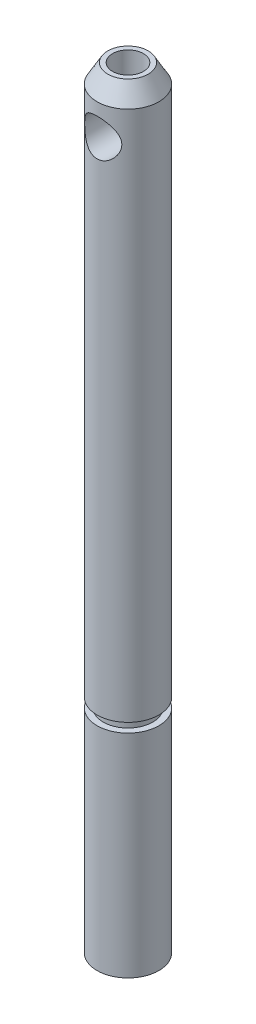
ISO-10303-21;
HEADER;
FILE_DESCRIPTION(('STEP AP214'),'2;1');
FILE_NAME('part.step','',(''),(''),'','','');
FILE_SCHEMA(('AUTOMOTIVE_DESIGN { 1 0 10303 214 1 1 1 1 }'));
ENDSEC;
DATA;
#1=APPLICATION_CONTEXT('core data for automotive mechanical design processes');
#2=APPLICATION_PROTOCOL_DEFINITION('international standard','automotive_design',2000,#1);
#3=PRODUCT_CONTEXT('',#1,'mechanical');
#4=PRODUCT('Part','Part','',(#3));
#5=PRODUCT_RELATED_PRODUCT_CATEGORY('part','',(#4));
#6=PRODUCT_DEFINITION_FORMATION('','',#4);
#7=PRODUCT_DEFINITION_CONTEXT('part definition',#1,'design');
#8=PRODUCT_DEFINITION('design','',#6,#7);
#9=PRODUCT_DEFINITION_SHAPE('','',#8);
#10=(LENGTH_UNIT() NAMED_UNIT(*) SI_UNIT(.MILLI.,.METRE.));
#11=(NAMED_UNIT(*) PLANE_ANGLE_UNIT() SI_UNIT($,.RADIAN.));
#12=(NAMED_UNIT(*) SI_UNIT($,.STERADIAN.) SOLID_ANGLE_UNIT());
#13=UNCERTAINTY_MEASURE_WITH_UNIT(LENGTH_MEASURE(1.E-05),#10,'distance_accuracy_value','');
#14=(GEOMETRIC_REPRESENTATION_CONTEXT(3) GLOBAL_UNCERTAINTY_ASSIGNED_CONTEXT((#13)) GLOBAL_UNIT_ASSIGNED_CONTEXT((#10,
#11,#12)) REPRESENTATION_CONTEXT('',''));
#15=CARTESIAN_POINT('',(0.,0.,0.));
#16=DIRECTION('',(0.,0.,1.));
#17=DIRECTION('',(1.,0.,0.));
#18=AXIS2_PLACEMENT_3D('',#15,#16,#17);
#19=CARTESIAN_POINT('',(0.,62.34264779,0.));
#20=DIRECTION('',(0.,-1.,0.));
#21=DIRECTION('',(0.,0.,-1.));
#22=AXIS2_PLACEMENT_3D('',#19,#20,#21);
#23=CYLINDRICAL_SURFACE('',#22,2.5);
#24=CARTESIAN_POINT('',(0.,17.9,0.));
#25=DIRECTION('',(0.,1.,0.));
#26=DIRECTION('',(0.,0.,1.));
#27=AXIS2_PLACEMENT_3D('',#24,#25,#26);
#28=CIRCLE('',#27,2.5);
#29=CARTESIAN_POINT('',(0.,17.9,2.5));
#30=VERTEX_POINT('',#29);
#31=EDGE_CURVE('E40',#30,#30,#28,.T.);
#32=ORIENTED_EDGE('',*,*,#31,.T.);
#33=EDGE_LOOP('',(#32));
#34=FACE_BOUND('',#33,.T.);
#35=CARTESIAN_POINT('',(-1.11022302462516E-13,59.84264779,-2.49999999999995));
#36=CARTESIAN_POINT('',(-0.0767298334621174,59.8426436989901,-2.4999962578972));
#37=CARTESIAN_POINT('',(-0.153582320644271,59.8367191190737,-2.49642904615007));
#38=CARTESIAN_POINT('',(-0.304975509530748,59.8133234704847,-2.48249903608569));
#39=CARTESIAN_POINT('',(-0.379510034596101,59.7958239281458,-2.47211948032716));
#40=CARTESIAN_POINT('',(-0.523751827790889,59.7502614288332,-2.44561558054483));
#41=CARTESIAN_POINT('',(-0.593481028226631,59.7222508318369,-2.42951973272941));
#42=CARTESIAN_POINT('',(-0.727030318214732,59.656787456859,-2.39295367626406));
#43=CARTESIAN_POINT('',(-0.790851869416452,59.6193370230312,-2.37248455380253));
#44=CARTESIAN_POINT('',(-0.916299278999388,59.5328729632914,-2.32705360719085));
#45=CARTESIAN_POINT('',(-0.977384020081503,59.4831940946486,-2.30186792195981));
#46=CARTESIAN_POINT('',(-1.09088270411895,59.3751805861718,-2.25030439279632));
#47=CARTESIAN_POINT('',(-1.1432853494811,59.3168348528127,-2.22392505153574));
#48=CARTESIAN_POINT('',(-1.24444996762973,59.1847242795032,-2.16911066995912));
#49=CARTESIAN_POINT('',(-1.29197766378817,59.1099460190188,-2.14082017703644));
#50=CARTESIAN_POINT('',(-1.37361437764906,58.9518012167569,-2.08938301412118));
#51=CARTESIAN_POINT('',(-1.40774517335162,58.8684488937524,-2.06622802273939));
#52=CARTESIAN_POINT('',(-1.45440601714227,58.7160513393467,-2.03354629660929));
#53=CARTESIAN_POINT('',(-1.47016197246839,58.6484117913897,-2.02207883137583));
#54=CARTESIAN_POINT('',(-1.49216172340484,58.5108440741697,-2.00590308295495));
#55=CARTESIAN_POINT('',(-1.49841734556833,58.4409188612455,-2.00118639643758));
#56=CARTESIAN_POINT('',(-1.50105508796006,58.3006362957827,-1.99920922463854));
#57=CARTESIAN_POINT('',(-1.49741783408428,58.2302783649068,-2.0019633701271));
#58=CARTESIAN_POINT('',(-1.4804606047884,58.0913690145724,-2.01453261443733));
#59=CARTESIAN_POINT('',(-1.46713334620107,58.0228189941526,-2.02435302432224));
#60=CARTESIAN_POINT('',(-1.43173921881794,57.8901175478719,-2.04953186944256));
#61=CARTESIAN_POINT('',(-1.40978748666095,57.8259207360755,-2.06481711652529));
#62=CARTESIAN_POINT('',(-1.35795061770849,57.7019527990718,-2.09927051350823));
#63=CARTESIAN_POINT('',(-1.32806257259713,57.6421833065761,-2.11844008623469));
#64=CARTESIAN_POINT('',(-1.2551798318459,57.5176636928772,-2.16255327268992));
#65=CARTESIAN_POINT('',(-1.21080724397733,57.4538696970451,-2.18792043372989));
#66=CARTESIAN_POINT('',(-1.11291092784015,57.333971306333,-2.23930599764373));
#67=CARTESIAN_POINT('',(-1.05937845100591,57.2778743560235,-2.26532500262146));
#68=CARTESIAN_POINT('',(-0.935811834383079,57.1670348081783,-2.31935504958316));
#69=CARTESIAN_POINT('',(-0.864517682705066,57.113570483984,-2.34713836268528));
#70=CARTESIAN_POINT('',(-0.712276050459084,57.0195257428021,-2.39772428433978));
#71=CARTESIAN_POINT('',(-0.631333763943626,56.9789384362101,-2.42052955425519));
#72=CARTESIAN_POINT('',(-0.467197585268263,56.9147156072041,-2.45730392066156));
#73=CARTESIAN_POINT('',(-0.384467624173656,56.8901724342841,-2.47173957439704));
#74=CARTESIAN_POINT('',(-0.215047895144745,56.8556365925946,-2.49218842813548));
#75=CARTESIAN_POINT('',(-0.128363005661436,56.8456264722464,-2.49821172952736));
#76=CARTESIAN_POINT('',(0.0337146143772834,56.8411399423217,-2.5009057037461));
#77=CARTESIAN_POINT('',(0.109042473418621,56.8447389349148,-2.49873521714286));
#78=CARTESIAN_POINT('',(0.257829401985992,56.8630736430719,-2.48778712087049));
#79=CARTESIAN_POINT('',(0.33128850937605,56.8778091328058,-2.47900964518037));
#80=CARTESIAN_POINT('',(0.472574932157574,56.9171912228125,-2.4559479244219));
#81=CARTESIAN_POINT('',(0.540495750928449,56.9415881390735,-2.44180275662557));
#82=CARTESIAN_POINT('',(0.671265749087234,56.9993251663653,-2.40913880862845));
#83=CARTESIAN_POINT('',(0.734113924963882,57.0326670413467,-2.39061916586509));
#84=CARTESIAN_POINT('',(0.860006262823819,57.1112047692087,-2.34845496237357));
#85=CARTESIAN_POINT('',(0.922394150456773,57.1572716190784,-2.3244780273988));
#86=CARTESIAN_POINT('',(1.03902603131008,57.2580391834886,-2.27474265574737));
#87=CARTESIAN_POINT('',(1.09326040273734,57.3127499448525,-2.24898216586368));
#88=CARTESIAN_POINT('',(1.19931996735574,57.4375581800371,-2.19445423909899));
#89=CARTESIAN_POINT('',(1.24991019630905,57.5087316754655,-2.16573241746296));
#90=CARTESIAN_POINT('',(1.33845238915658,57.6598638145682,-2.11216182066716));
#91=CARTESIAN_POINT('',(1.37641766769777,57.7398130838928,-2.08730897997701));
#92=CARTESIAN_POINT('',(1.43142578795771,57.8888908123067,-2.0498490924053));
#93=CARTESIAN_POINT('',(1.45121625336179,57.9566281023586,-2.03575659328737));
#94=CARTESIAN_POINT('',(1.48113663905961,58.0951798680801,-2.01409605743551));
#95=CARTESIAN_POINT('',(1.49127995297625,58.1659899343278,-2.00651897642729));
#96=CARTESIAN_POINT('',(1.50134130416625,58.309024737597,-1.99900446616276));
#97=CARTESIAN_POINT('',(1.50122089107857,58.381253780687,-1.99909576445944));
#98=CARTESIAN_POINT('',(1.49066472959318,58.5245422256094,-2.0069771789286));
#99=CARTESIAN_POINT('',(1.48022337215755,58.5956009700806,-2.01477148138835));
#100=CARTESIAN_POINT('',(1.45040174148908,58.7311362075722,-2.03633185242994));
#101=CARTESIAN_POINT('',(1.43147636845339,58.7957648843068,-2.04979211805588));
#102=CARTESIAN_POINT('',(1.38563242076985,58.9209850444742,-2.08105501960158));
#103=CARTESIAN_POINT('',(1.35871083588482,58.9815749969605,-2.09885929040494));
#104=CARTESIAN_POINT('',(1.29289245555737,59.1069676472208,-2.14012990550929));
#105=CARTESIAN_POINT('',(1.25279167675747,59.1709888938543,-2.16404587582644));
#106=CARTESIAN_POINT('',(1.16375698389073,59.2920278626172,-2.21320127030773));
#107=CARTESIAN_POINT('',(1.11481579607792,59.3490397521525,-2.23844177205034));
#108=CARTESIAN_POINT('',(1.0000977742573,59.4639987391317,-2.29225690291491));
#109=CARTESIAN_POINT('',(0.932876819313819,59.5205788648962,-2.32070308663664));
#110=CARTESIAN_POINT('',(0.788462434445498,59.6217456458633,-2.37365428872368));
#111=CARTESIAN_POINT('',(0.71126544450149,59.6663280019848,-2.3981578931094));
#112=CARTESIAN_POINT('',(0.551125230801416,59.7404335975737,-2.439855786544));
#113=CARTESIAN_POINT('',(0.468430086957148,59.7703758549268,-2.4572507747979));
#114=CARTESIAN_POINT('',(0.297973306118717,59.815372485211,-2.48366273001245));
#115=CARTESIAN_POINT('',(0.210232099648526,59.8304829578571,-2.49271125871481));
#116=CARTESIAN_POINT('',(0.101558096917439,59.8393452447087,-2.49802001168187));
#117=CARTESIAN_POINT('',(0.0812762590281778,59.8405822073061,-2.49876114656363));
#118=CARTESIAN_POINT('',(0.0406658206870069,59.8422340363708,-2.49975164517366));
#119=CARTESIAN_POINT('',(0.0203372186374612,59.8426488743209,-2.50000099184312));
#120=CARTESIAN_POINT('',(-1.11022302462516E-13,59.84264779,-2.49999999999995));
#121=B_SPLINE_CURVE_WITH_KNOTS('',3,(#35,#36,#37,#38,#39,#40,#41,#42,#43,#44,#45,#46,#47,#48,
#49,#50,#51,#52,#53,#54,#55,#56,#57,#58,#59,#60,#61,#62,#63,#64,#65,#66,#67,#68,#69,#70,#71,#72,
#73,#74,#75,#76,#77,#78,#79,#80,#81,#82,#83,#84,#85,#86,#87,#88,#89,#90,#91,#92,#93,#94,#95,#96,
#97,#98,#99,#100,#101,#102,#103,#104,#105,#106,#107,#108,#109,#110,#111,#112,#113,#114,#115,
#116,#117,#118,#119,#120),.UNSPECIFIED.,.T.,.F.,(4,2,2,2,2,2,2,2,2,2,2,2,2,2,2,2,2,2,2,2,2,2,2,
2,2,2,2,2,2,2,2,2,2,2,2,2,2,2,2,2,2,2,4),(0.,0.230102237548619,0.460772627519939,
0.690308884599963,0.919788197992259,1.16681590732466,1.41416257934789,1.69183813189801,
1.96906040692088,2.17933829855627,2.3893542091657,2.59978170870722,2.8103675327387,
3.01823267593203,3.22617409809863,3.47046995225156,3.71500044803666,3.99360957884687,
4.27206939275325,4.53296790696556,4.79355286918228,5.01875602722423,5.24395461863456,
5.46367785689774,5.68344445659029,5.92601365818361,6.16886690081831,6.44336762428004,
6.71757792616452,6.93257787314688,7.14727888733312,7.36278425777426,7.57840681155719,
7.78364098331133,7.98895251523023,8.22578610052278,8.46281544370203,8.73854311775512,
9.01436946031975,9.2817565446267,9.54812832184443,9.60911473335172,9.67010326027637),.UNSPECIFIED.);
#122=CARTESIAN_POINT('',(-1.11022302462516E-13,59.84264779,-2.49999999999995));
#123=VERTEX_POINT('',#122);
#124=EDGE_CURVE('E87',#123,#123,#121,.T.);
#125=ORIENTED_EDGE('',*,*,#124,.T.);
#126=EDGE_LOOP('',(#125));
#127=FACE_BOUND('',#126,.T.);
#128=CARTESIAN_POINT('',(1.50000000000006,58.34264779,1.99999999999989));
#129=CARTESIAN_POINT('',(1.50000404108597,58.2671688147104,1.99999416642502));
#130=CARTESIAN_POINT('',(1.49426852824004,58.1917093559202,2.00433633903488));
#131=CARTESIAN_POINT('',(1.47174965152777,58.0433238860378,2.02092590613891));
#132=CARTESIAN_POINT('',(1.45495475788939,57.9704006026149,2.03318155043089));
#133=CARTESIAN_POINT('',(1.41143486335801,57.8295641483227,2.0636233903472));
#134=CARTESIAN_POINT('',(1.38478154503145,57.7616189519648,2.08176666183123));
#135=CARTESIAN_POINT('',(1.32252909283014,57.6312103366322,2.12185904995839));
#136=CARTESIAN_POINT('',(1.28692729054697,57.5687485603049,2.14380930122404));
#137=CARTESIAN_POINT('',(1.20271292747652,57.4426987733359,2.19228594587526));
#138=CARTESIAN_POINT('',(1.15304179435289,57.3799068328761,2.21904371037659));
#139=CARTESIAN_POINT('',(1.04426801309981,57.2628830272583,2.27226229431066));
#140=CARTESIAN_POINT('',(0.985158296729598,57.2086576383292,2.29872287517103));
#141=CARTESIAN_POINT('',(0.851442367411699,57.1045139802903,2.35175567858731));
#142=CARTESIAN_POINT('',(0.775851995162529,57.0556933263303,2.37803133577816));
#143=CARTESIAN_POINT('',(0.615654228271661,56.9718380675556,2.42443786983181));
#144=CARTESIAN_POINT('',(0.531055196626372,56.9367908158773,2.4445743798874));
#145=CARTESIAN_POINT('',(0.363771406742733,56.8850518671873,2.47470987800445));
#146=CARTESIAN_POINT('',(0.281674698130973,56.8669274290327,2.48549303939172));
#147=CARTESIAN_POINT('',(0.114970509382765,56.8447049871369,2.49874939277542));
#148=CARTESIAN_POINT('',(0.0303654624002182,56.8405938119999,2.50123038813301));
#149=CARTESIAN_POINT('',(-0.127637283737264,56.8462615373424,2.49783372711535));
#150=CARTESIAN_POINT('',(-0.201123832865614,56.8543813161693,2.49295437513726));
#151=CARTESIAN_POINT('',(-0.345464269151774,56.8811275856481,2.47707997553857));
#152=CARTESIAN_POINT('',(-0.41631796105121,56.8997548539071,2.46608447529306));
#153=CARTESIAN_POINT('',(-0.554056780469106,56.9468133527038,2.43884907201714));
#154=CARTESIAN_POINT('',(-0.620916491037661,56.9753008511389,2.42257910450821));
#155=CARTESIAN_POINT('',(-0.74898866011564,57.0410324062255,2.38609637638749));
#156=CARTESIAN_POINT('',(-0.81019964620801,57.078278737059,2.36588259201815));
#157=CARTESIAN_POINT('',(-0.933074267143204,57.1654868828044,2.32037925976365));
#158=CARTESIAN_POINT('',(-0.993918663198241,57.2164361017356,2.29477182952148));
#159=CARTESIAN_POINT('',(-1.10671465909276,57.3270519078601,2.242555542456));
#160=CARTESIAN_POINT('',(-1.15865401308333,57.3867302934745,2.2159453670338));
#161=CARTESIAN_POINT('',(-1.25824837767412,57.5213011961636,2.1611107512395));
#162=CARTESIAN_POINT('',(-1.30470933188639,57.5971553665394,2.13305661385121));
#163=CARTESIAN_POINT('',(-1.38397217194241,57.7573540216365,2.0825087955726));
#164=CARTESIAN_POINT('',(-1.41679921962188,57.8416825061256,2.06000490298818));
#165=CARTESIAN_POINT('',(-1.46077497064846,57.9950414218953,2.02895865196727));
#166=CARTESIAN_POINT('',(-1.47527903312676,58.0626884222966,2.01833888618307));
#167=CARTESIAN_POINT('',(-1.49480872755294,58.2000214002994,2.0039215077755));
#168=CARTESIAN_POINT('',(-1.49984538302908,58.2697049104845,2.00011596115112));
#169=CARTESIAN_POINT('',(-1.50014781114185,58.4091994724357,1.99988914321318));
#170=CARTESIAN_POINT('',(-1.49540004697672,58.4790105672152,2.00347810223975));
#171=CARTESIAN_POINT('',(-1.47640290574949,58.6166351337486,2.01751520788646));
#172=CARTESIAN_POINT('',(-1.46214601830133,58.6844469822403,2.02796877613213));
#173=CARTESIAN_POINT('',(-1.42488312618649,58.8163623694798,2.05431768333102));
#174=CARTESIAN_POINT('',(-1.40188805257368,58.8804704265323,2.07020622092808));
#175=CARTESIAN_POINT('',(-1.34796261057081,59.0041255057302,2.10571539417582));
#176=CARTESIAN_POINT('',(-1.31702924888211,59.063670796366,2.12533743689998));
#177=CARTESIAN_POINT('',(-1.24167439558507,59.1878878725122,2.17036819177738));
#178=CARTESIAN_POINT('',(-1.19582663060306,59.2515486250966,2.19618239397367));
#179=CARTESIAN_POINT('',(-1.09487395518707,59.3709332748495,2.24821754803618));
#180=CARTESIAN_POINT('',(-1.03976018672402,59.4266494821691,2.27443886711456));
#181=CARTESIAN_POINT('',(-0.913274837212728,59.5358717973504,2.32835625910917));
#182=CARTESIAN_POINT('',(-0.840721108780187,59.5881485166059,2.35580075875872));
#183=CARTESIAN_POINT('',(-0.686103100868014,59.6795505668367,2.40537639133457));
#184=CARTESIAN_POINT('',(-0.604045176134661,59.7186846178409,2.42751104449406));
#185=CARTESIAN_POINT('',(-0.438840232972077,59.7795159934314,2.46252280092772));
#186=CARTESIAN_POINT('',(-0.35620596365121,59.8022740177911,2.47595588067328));
#187=CARTESIAN_POINT('',(-0.187383063890822,59.8333623928463,2.49440738906101));
#188=CARTESIAN_POINT('',(-0.101198571781933,59.8417090807176,2.49943534582738));
#189=CARTESIAN_POINT('',(0.0598120232010074,59.8433223985859,2.50040600461976));
#190=CARTESIAN_POINT('',(0.134620583589719,59.838451124563,2.49747057186327));
#191=CARTESIAN_POINT('',(0.282148755978779,59.8177539656184,2.48512948412096));
#192=CARTESIAN_POINT('',(0.354868344701922,59.8019279586784,2.4757237570664));
#193=CARTESIAN_POINT('',(0.495145481978799,59.7604282184162,2.45149427526962));
#194=CARTESIAN_POINT('',(0.562767032608823,59.7349161938707,2.43675966858905));
#195=CARTESIAN_POINT('',(0.69278197200002,59.6750071954452,2.40303337447155));
#196=CARTESIAN_POINT('',(0.75517418419992,59.6406082291404,2.38404073252271));
#197=CARTESIAN_POINT('',(0.880263645296024,59.5597225934312,2.34093432659385));
#198=CARTESIAN_POINT('',(0.942258690439942,59.512329080983,2.31648844639152));
#199=CARTESIAN_POINT('',(1.05789751536307,59.4088947562822,2.26601907350658));
#200=CARTESIAN_POINT('',(1.11153190956925,59.3528443643921,2.23999385274502));
#201=CARTESIAN_POINT('',(1.21590975350577,59.2253622278223,2.185281656662));
#202=CARTESIAN_POINT('',(1.26542406663362,59.1528813038344,2.15667566270905));
#203=CARTESIAN_POINT('',(1.35156817210321,58.9991629372333,2.10376464485147));
#204=CARTESIAN_POINT('',(1.38820466322671,58.9179300760185,2.07945738811042));
#205=CARTESIAN_POINT('',(1.44437116535138,58.7555835048628,2.04080003047955));
#206=CARTESIAN_POINT('',(1.46509526060177,58.6750525540387,2.02577665830147));
#207=CARTESIAN_POINT('',(1.49289268240416,58.5105503952962,2.00539032320042));
#208=CARTESIAN_POINT('',(1.49999550595843,58.4265870242412,2.00000648744631));
#209=CARTESIAN_POINT('',(1.50000000000006,58.34264779,1.99999999999989));
#210=B_SPLINE_CURVE_WITH_KNOTS('',3,(#128,#129,#130,#131,#132,#133,#134,#135,#136,#137,#138,
#139,#140,#141,#142,#143,#144,#145,#146,#147,#148,#149,#150,#151,#152,#153,#154,#155,#156,#157,
#158,#159,#160,#161,#162,#163,#164,#165,#166,#167,#168,#169,#170,#171,#172,#173,#174,#175,#176,
#177,#178,#179,#180,#181,#182,#183,#184,#185,#186,#187,#188,#189,#190,#191,#192,#193,#194,#195,
#196,#197,#198,#199,#200,#201,#202,#203,#204,#205,#206,#207,#208,#209),.UNSPECIFIED.,.T.,.F.,(4,
2,2,2,2,2,2,2,2,2,2,2,2,2,2,2,2,2,2,2,2,2,2,2,2,2,2,2,2,2,2,2,2,2,2,2,2,2,2,2,4),(0.,
0.226085249493357,0.452406574330706,0.677113624991797,0.901887762215826,1.15414462389994,
1.40659128601841,1.68630157736218,1.96575443271212,2.21853330858488,2.47107452602757,
2.69230130543177,2.91354445887945,3.13607155036375,3.35865648368874,3.60782810055843,
3.85733966656903,4.13576671140274,4.41367760154768,4.62276298054685,4.83160475643979,
5.04073566011189,5.25003193304139,5.45906724365505,5.66818149154669,5.91499438482012,
6.16204457978465,6.441218280116,6.72020638384861,6.97891479383351,7.23732973022738,
7.46129321849409,7.68525920139656,7.90563970188768,8.126069653946,8.37042963549502,
8.6150619874197,8.89071695766618,9.16622832484817,9.41820120134364,9.66962780912285),.UNSPECIFIED.);
#211=CARTESIAN_POINT('',(1.50000000000006,58.34264779,1.99999999999989));
#212=VERTEX_POINT('',#211);
#213=EDGE_CURVE('E80',#212,#212,#210,.T.);
#214=ORIENTED_EDGE('',*,*,#213,.T.);
#215=EDGE_LOOP('',(#214));
#216=FACE_BOUND('',#215,.T.);
#217=CARTESIAN_POINT('',(0.,60.84264779,0.));
#218=DIRECTION('',(0.,1.,0.));
#219=DIRECTION('',(0.,0.,1.));
#220=AXIS2_PLACEMENT_3D('',#217,#218,#219);
#221=CIRCLE('',#220,2.5);
#222=CARTESIAN_POINT('',(0.,60.84264779,2.5));
#223=VERTEX_POINT('',#222);
#224=EDGE_CURVE('E114',#223,#223,#221,.F.);
#225=ORIENTED_EDGE('',*,*,#224,.T.);
#226=EDGE_LOOP('',(#225));
#227=FACE_BOUND('',#226,.T.);
#228=ADVANCED_FACE('F36',(#34,#127,#216,#227),#23,.T.);
#229=CARTESIAN_POINT('',(0.,62.34264779,0.));
#230=DIRECTION('',(0.,1.,0.));
#231=DIRECTION('',(0.,0.,1.));
#232=AXIS2_PLACEMENT_3D('',#229,#230,#231);
#233=PLANE('',#232);
#234=CARTESIAN_POINT('',(0.,62.34264779,0.));
#235=DIRECTION('',(0.,1.,0.));
#236=DIRECTION('',(0.,0.,1.));
#237=AXIS2_PLACEMENT_3D('',#234,#235,#236);
#238=CIRCLE('',#237,1.24999999999999);
#239=CARTESIAN_POINT('',(0.,62.34264779,1.24999999999999));
#240=VERTEX_POINT('',#239);
#241=EDGE_CURVE('E165',#240,#240,#238,.T.);
#242=ORIENTED_EDGE('',*,*,#241,.F.);
#243=EDGE_LOOP('',(#242));
#244=FACE_BOUND('',#243,.T.);
#245=CARTESIAN_POINT('',(0.,62.34264779,0.));
#246=DIRECTION('',(0.,1.,0.));
#247=DIRECTION('',(0.,0.,1.));
#248=AXIS2_PLACEMENT_3D('',#245,#246,#247);
#249=CIRCLE('',#248,1.63397459621555);
#250=CARTESIAN_POINT('',(0.,62.34264779,1.63397459621555));
#251=VERTEX_POINT('',#250);
#252=EDGE_CURVE('E164',#251,#251,#249,.T.);
#253=ORIENTED_EDGE('',*,*,#252,.T.);
#254=EDGE_LOOP('',(#253));
#255=FACE_BOUND('',#254,.T.);
#256=ADVANCED_FACE('F144',(#244,#255),#233,.T.);
#257=CARTESIAN_POINT('',(0.,62.34264779,0.));
#258=DIRECTION('',(0.,-1.,0.));
#259=DIRECTION('',(0.,0.,-1.));
#260=AXIS2_PLACEMENT_3D('',#257,#258,#259);
#261=CONICAL_SURFACE('',#260,1.63397459621555,0.523598775598299);
#262=ORIENTED_EDGE('',*,*,#224,.F.);
#263=EDGE_LOOP('',(#262));
#264=FACE_BOUND('',#263,.T.);
#265=ORIENTED_EDGE('',*,*,#252,.F.);
#266=EDGE_LOOP('',(#265));
#267=FACE_BOUND('',#266,.T.);
#268=ADVANCED_FACE('F38',(#264,#267),#261,.T.);
#269=CARTESIAN_POINT('',(0.,62.34264779,0.));
#270=DIRECTION('',(0.,1.,0.));
#271=DIRECTION('',(0.,0.,1.));
#272=AXIS2_PLACEMENT_3D('',#269,#270,#271);
#273=CYLINDRICAL_SURFACE('',#272,1.24999999999999);
#274=CARTESIAN_POINT('',(0.,59.84264779,1.24999999999997));
#275=CARTESIAN_POINT('',(-0.0593787688504902,59.8426453960051,1.24999755162012));
#276=CARTESIAN_POINT('',(-0.118775657075955,59.8390911230602,1.24573873608633));
#277=CARTESIAN_POINT('',(-0.235591229710231,59.8252016242696,1.22901865029432));
#278=CARTESIAN_POINT('',(-0.29300841589432,59.8148613764697,1.21655130529971));
#279=CARTESIAN_POINT('',(-0.403915034737275,59.7883611698592,1.18434389929647));
#280=CARTESIAN_POINT('',(-0.457425697494237,59.7722360079471,1.16464730700097));
#281=CARTESIAN_POINT('',(-0.559920458095034,59.7352939358074,1.1189916319036));
#282=CARTESIAN_POINT('',(-0.60890301880444,59.7144754405418,1.09303043320275));
#283=CARTESIAN_POINT('',(-0.718951202770143,59.6610173962405,1.02527232994856));
#284=CARTESIAN_POINT('',(-0.777846384687494,59.6268446330919,0.981161424597099));
#285=CARTESIAN_POINT('',(-0.88600669034169,59.5547668337134,0.884741320224268));
#286=CARTESIAN_POINT('',(-0.935244207719127,59.5168515508956,0.832409367774614));
#287=CARTESIAN_POINT('',(-1.02476981505217,59.4396432682186,0.719475666551739));
#288=CARTESIAN_POINT('',(-1.06487540714465,59.4003377572932,0.65873878899535));
#289=CARTESIAN_POINT('',(-1.13460946975338,59.3251211682379,0.529649327753183));
#290=CARTESIAN_POINT('',(-1.16426870455498,59.2892003550434,0.461319899248879));
#291=CARTESIAN_POINT('',(-1.2009680938634,59.2416144929299,0.349152321823399));
#292=CARTESIAN_POINT('',(-1.21216917699589,59.2263312437798,0.308234151359252));
#293=CARTESIAN_POINT('',(-1.23050643018313,59.2006117998924,0.224058908581022));
#294=CARTESIAN_POINT('',(-1.23765246650147,59.1901638520024,0.180807796016875));
#295=CARTESIAN_POINT('',(-1.24740539483337,59.1757529297614,0.0921161932337585));
#296=CARTESIAN_POINT('',(-1.24995600781895,59.1718703953019,0.0466554691685001));
#297=CARTESIAN_POINT('',(-1.25004286433055,59.1717392801723,-0.0442807551980311));
#298=CARTESIAN_POINT('',(-1.24757904212986,59.1754907995654,-0.0897562556851739));
#299=CARTESIAN_POINT('',(-1.23752620102334,59.1903556786056,-0.182763549838961));
#300=CARTESIAN_POINT('',(-1.22952745139611,59.2020561024571,-0.230151202597545));
#301=CARTESIAN_POINT('',(-1.20871318849993,59.231090323166,-0.322101145839428));
#302=CARTESIAN_POINT('',(-1.19588169148347,59.248442787456,-0.366653480876624));
#303=CARTESIAN_POINT('',(-1.15722563130137,59.2977869247082,-0.478104397695259));
#304=CARTESIAN_POINT('',(-1.12819923859676,59.3323823317423,-0.542714880205897));
#305=CARTESIAN_POINT('',(-1.0607172410451,59.4044114169617,-0.66502873901156));
#306=CARTESIAN_POINT('',(-1.02224478491081,59.4418500840155,-0.722719494040659));
#307=CARTESIAN_POINT('',(-0.933838554257848,59.5180327498887,-0.834120412783252));
#308=CARTESIAN_POINT('',(-0.883411408236051,59.556742899928,-0.887465696388253));
#309=CARTESIAN_POINT('',(-0.772419565040695,59.6301969049584,-0.985559630438903));
#310=CARTESIAN_POINT('',(-0.711877274428563,59.6649492470877,-1.03032682216843));
#311=CARTESIAN_POINT('',(-0.59705631416896,59.7197916838296,-1.09970681083113));
#312=CARTESIAN_POINT('',(-0.544863772530677,59.7413893589319,-1.12657128594302));
#313=CARTESIAN_POINT('',(-0.435535617240919,59.7791869914236,-1.1731715356764));
#314=CARTESIAN_POINT('',(-0.378403116632057,59.7953903174189,-1.19291175982449));
#315=CARTESIAN_POINT('',(-0.259977180591779,59.8211969118404,-1.22420858059791));
#316=CARTESIAN_POINT('',(-0.198655468325038,59.8307491801647,-1.23570196071463));
#317=CARTESIAN_POINT('',(-0.0742799817039903,59.8421049772496,-1.24935462856928));
#318=CARTESIAN_POINT('',(-0.0112273946835203,59.8439136904991,-1.25152016152218));
#319=CARTESIAN_POINT('',(0.106655102299903,59.839872777293,-1.2466687749113));
#320=CARTESIAN_POINT('',(0.161565285324155,59.8349145251792,-1.24072067022759));
#321=CARTESIAN_POINT('',(0.269322467292328,59.8192757557052,-1.22186653531031));
#322=CARTESIAN_POINT('',(0.322169217931461,59.808594551932,-1.20895967043917));
#323=CARTESIAN_POINT('',(0.425282807428064,59.7820953311318,-1.17668826548714));
#324=CARTESIAN_POINT('',(0.475505558665462,59.7662103651791,-1.15723946784767));
#325=CARTESIAN_POINT('',(0.571829286856163,59.7303286630424,-1.11280232131271));
#326=CARTESIAN_POINT('',(0.617928731328829,59.7103304071373,-1.08781192471693));
#327=CARTESIAN_POINT('',(0.725338376691851,59.6575222014701,-1.02078335853516));
#328=CARTESIAN_POINT('',(0.784177111169704,59.6229929252154,-0.976130353623708));
#329=CARTESIAN_POINT('',(0.892139643516418,59.5502661221268,-0.878583173972398));
#330=CARTESIAN_POINT('',(0.941232285418773,59.5120573931547,-0.825663506224549));
#331=CARTESIAN_POINT('',(1.03033901299864,59.434412103151,-0.711512047530491));
#332=CARTESIAN_POINT('',(1.07017375330089,59.3949658211159,-0.650147769366086));
#333=CARTESIAN_POINT('',(1.13922410535005,59.3197536503251,-0.519707419852047));
#334=CARTESIAN_POINT('',(1.16847444328378,59.283976007252,-0.450657557281258));
#335=CARTESIAN_POINT('',(1.20418713962592,59.237282978877,-0.337851015294674));
#336=CARTESIAN_POINT('',(1.21494166451882,59.2225033250451,-0.297079061568867));
#337=CARTESIAN_POINT('',(1.23241118575504,59.1978611382934,-0.213277726588236));
#338=CARTESIAN_POINT('',(1.23913627036995,59.1879863360877,-0.170254278728971));
#339=CARTESIAN_POINT('',(1.24808646608228,59.1747248857972,-0.0821801196691208));
#340=CARTESIAN_POINT('',(1.25025897513145,59.1714141039902,-0.037111793051657));
#341=CARTESIAN_POINT('',(1.2496910063161,59.1722692743892,0.0529260641758383));
#342=CARTESIAN_POINT('',(1.24694923297199,59.1764371980961,0.0978955656050557));
#343=CARTESIAN_POINT('',(1.23632620681839,59.1921119726516,0.190837495965895));
#344=CARTESIAN_POINT('',(1.22792861456552,59.2043532628057,0.238619561874913));
#345=CARTESIAN_POINT('',(1.20625214805457,59.2344428170982,0.331261206708348));
#346=CARTESIAN_POINT('',(1.19295712996405,59.2523095964306,0.376110535798331));
#347=CARTESIAN_POINT('',(1.15299054037424,59.3029411710797,0.488341798149877));
#348=CARTESIAN_POINT('',(1.12305667484076,59.3382713602981,0.553381329033072));
#349=CARTESIAN_POINT('',(1.05354944095064,59.4115788715155,0.676409635896389));
#350=CARTESIAN_POINT('',(1.0139591175589,59.4495607647865,0.73438573828648));
#351=CARTESIAN_POINT('',(0.923157683511314,59.5264960452725,0.845990753379524));
#352=CARTESIAN_POINT('',(0.871472234833868,59.5654058497595,0.899267484501733));
#353=CARTESIAN_POINT('',(0.75776534327971,59.638934185746,0.996935304625636));
#354=CARTESIAN_POINT('',(0.695767358080687,59.6735621522714,1.04134606754816));
#355=CARTESIAN_POINT('',(0.579278005881037,59.7273586522703,1.10915651690689));
#356=CARTESIAN_POINT('',(0.526999500141233,59.7482084825278,1.13501910031225));
#357=CARTESIAN_POINT('',(0.417719782772113,59.7844552706012,1.17960948970957));
#358=CARTESIAN_POINT('',(0.360724986716884,59.7998594903665,1.19834680009585));
#359=CARTESIAN_POINT('',(0.253310041564223,59.8219414832244,1.22509419634341));
#360=CARTESIAN_POINT('',(0.20342273942505,59.8296584911981,1.23438755201362));
#361=CARTESIAN_POINT('',(0.102361357783533,59.8400124147633,1.24684119321786));
#362=CARTESIAN_POINT('',(0.0511874114043579,59.842649853741,1.25000211062351));
#363=CARTESIAN_POINT('',(0.,59.84264779,1.24999999999997));
#364=B_SPLINE_CURVE_WITH_KNOTS('',3,(#274,#275,#276,#277,#278,#279,#280,#281,#282,#283,#284,
#285,#286,#287,#288,#289,#290,#291,#292,#293,#294,#295,#296,#297,#298,#299,#300,#301,#302,#303,
#304,#305,#306,#307,#308,#309,#310,#311,#312,#313,#314,#315,#316,#317,#318,#319,#320,#321,#322,
#323,#324,#325,#326,#327,#328,#329,#330,#331,#332,#333,#334,#335,#336,#337,#338,#339,#340,#341,
#342,#343,#344,#345,#346,#347,#348,#349,#350,#351,#352,#353,#354,#355,#356,#357,#358,#359,#360,
#361,#362,#363),.UNSPECIFIED.,.T.,.F.,(4,2,2,2,2,2,2,2,2,2,2,2,2,2,2,2,2,2,2,2,2,2,2,2,2,2,2,2,
2,2,2,2,2,2,2,2,2,2,2,2,2,2,2,2,4),(0.,0.177920638407535,0.35597309551343,0.53297202679771,
0.710030824150546,0.952125893800628,1.19490321558388,1.44217376408648,1.68870989486934,
1.82361318167476,1.95818681458035,2.09439761612086,2.23061020305621,2.37816635242827,
2.5262148743005,2.76143398970625,2.99707581215799,3.24501566810448,3.4924134101475,
3.67933989515102,3.8661494303655,4.05437609196173,4.24247671173494,4.40804641875277,
4.5736359887125,4.74144560410116,4.90931733118529,5.15261089108589,5.39667010414641,
5.64512295341111,5.89275310452962,6.02641745468288,6.15974574356447,6.29460624678861,
6.42950230652127,6.57876724728631,6.72852869227178,6.96677041328339,7.20543349464887,
7.45579032127001,7.70558526561255,7.89070171070695,8.07557035570183,8.22896247938916,
8.38233879708318),.UNSPECIFIED.);
#365=CARTESIAN_POINT('',(0.,59.84264779,1.24999999999997));
#366=VERTEX_POINT('',#365);
#367=EDGE_CURVE('E76',#366,#366,#364,.T.);
#368=ORIENTED_EDGE('',*,*,#367,.T.);
#369=EDGE_LOOP('',(#368));
#370=FACE_BOUND('',#369,.T.);
#371=ORIENTED_EDGE('',*,*,#241,.T.);
#372=EDGE_LOOP('',(#371));
#373=FACE_BOUND('',#372,.T.);
#374=ADVANCED_FACE('F100',(#370,#373),#273,.F.);
#375=CARTESIAN_POINT('',(-1.11022302462516E-13,58.34264779,-2.49999999999995));
#376=DIRECTION('',(0.,0.,1.));
#377=DIRECTION('',(1.,0.,0.));
#378=AXIS2_PLACEMENT_3D('',#375,#376,#377);
#379=CYLINDRICAL_SURFACE('',#378,1.5);
#380=ORIENTED_EDGE('',*,*,#367,.F.);
#381=EDGE_LOOP('',(#380));
#382=FACE_BOUND('',#381,.T.);
#383=ORIENTED_EDGE('',*,*,#213,.F.);
#384=EDGE_LOOP('',(#383));
#385=FACE_BOUND('',#384,.T.);
#386=ORIENTED_EDGE('',*,*,#124,.F.);
#387=EDGE_LOOP('',(#386));
#388=FACE_BOUND('',#387,.T.);
#389=ADVANCED_FACE('F94',(#382,#385,#388),#379,.F.);
#390=CARTESIAN_POINT('',(0.,17.9,0.));
#391=DIRECTION('',(0.,1.,0.));
#392=DIRECTION('',(0.,0.,1.));
#393=AXIS2_PLACEMENT_3D('',#390,#391,#392);
#394=PLANE('',#393);
#395=CARTESIAN_POINT('',(0.,17.9,0.));
#396=DIRECTION('',(0.,1.,0.));
#397=DIRECTION('',(0.,0.,1.));
#398=AXIS2_PLACEMENT_3D('',#395,#396,#397);
#399=CIRCLE('',#398,2.);
#400=CARTESIAN_POINT('',(0.,17.9,2.));
#401=VERTEX_POINT('',#400);
#402=EDGE_CURVE('E118',#401,#401,#399,.T.);
#403=ORIENTED_EDGE('',*,*,#402,.T.);
#404=EDGE_LOOP('',(#403));
#405=FACE_BOUND('',#404,.T.);
#406=ORIENTED_EDGE('',*,*,#31,.F.);
#407=EDGE_LOOP('',(#406));
#408=FACE_BOUND('',#407,.T.);
#409=ADVANCED_FACE('F99',(#405,#408),#394,.F.);
#410=CARTESIAN_POINT('',(0.,17.15,0.));
#411=DIRECTION('',(0.,1.,0.));
#412=DIRECTION('',(0.,0.,1.));
#413=AXIS2_PLACEMENT_3D('',#410,#411,#412);
#414=PLANE('',#413);
#415=CARTESIAN_POINT('',(0.,17.15,0.));
#416=DIRECTION('',(0.,1.,0.));
#417=DIRECTION('',(0.,0.,1.));
#418=AXIS2_PLACEMENT_3D('',#415,#416,#417);
#419=CIRCLE('',#418,2.);
#420=CARTESIAN_POINT('',(0.,17.15,2.));
#421=VERTEX_POINT('',#420);
#422=EDGE_CURVE('E123',#421,#421,#419,.T.);
#423=ORIENTED_EDGE('',*,*,#422,.F.);
#424=EDGE_LOOP('',(#423));
#425=FACE_BOUND('',#424,.T.);
#426=CARTESIAN_POINT('',(0.,17.15,0.));
#427=DIRECTION('',(0.,1.,0.));
#428=DIRECTION('',(0.,0.,1.));
#429=AXIS2_PLACEMENT_3D('',#426,#427,#428);
#430=CIRCLE('',#429,2.5);
#431=CARTESIAN_POINT('',(0.,17.15,2.5));
#432=VERTEX_POINT('',#431);
#433=EDGE_CURVE('E116',#432,#432,#430,.T.);
#434=ORIENTED_EDGE('',*,*,#433,.T.);
#435=EDGE_LOOP('',(#434));
#436=FACE_BOUND('',#435,.T.);
#437=ADVANCED_FACE('F132',(#425,#436),#414,.T.);
#438=CARTESIAN_POINT('',(0.,17.9,0.));
#439=DIRECTION('',(0.,-1.,0.));
#440=DIRECTION('',(0.,0.,-1.));
#441=AXIS2_PLACEMENT_3D('',#438,#439,#440);
#442=CYLINDRICAL_SURFACE('',#441,2.);
#443=ORIENTED_EDGE('',*,*,#402,.F.);
#444=EDGE_LOOP('',(#443));
#445=FACE_BOUND('',#444,.T.);
#446=ORIENTED_EDGE('',*,*,#422,.T.);
#447=EDGE_LOOP('',(#446));
#448=FACE_BOUND('',#447,.T.);
#449=ADVANCED_FACE('F130',(#445,#448),#442,.T.);
#450=CARTESIAN_POINT('',(0.,0.,0.));
#451=DIRECTION('',(0.,1.,0.));
#452=DIRECTION('',(0.,0.,1.));
#453=AXIS2_PLACEMENT_3D('',#450,#451,#452);
#454=PLANE('',#453);
#455=CARTESIAN_POINT('',(0.,0.,0.));
#456=DIRECTION('',(0.,1.,0.));
#457=DIRECTION('',(0.,0.,1.));
#458=AXIS2_PLACEMENT_3D('',#455,#456,#457);
#459=CIRCLE('',#458,2.5);
#460=CARTESIAN_POINT('',(-1.49999999999995,0.,2.));
#461=VERTEX_POINT('',#460);
#462=CARTESIAN_POINT('',(-1.50000000000006,0.,-2.));
#463=VERTEX_POINT('',#462);
#464=EDGE_CURVE('E74',#461,#463,#459,.T.);
#465=ORIENTED_EDGE('',*,*,#464,.F.);
#466=DIRECTION('',(0.,0.,-1.));
#467=VECTOR('',#466,1.);
#468=CARTESIAN_POINT('',(-1.50000000000006,0.,0.));
#469=LINE('',#468,#467);
#470=EDGE_CURVE('E45',#461,#463,#469,.T.);
#471=ORIENTED_EDGE('',*,*,#470,.T.);
#472=EDGE_LOOP('',(#465,#471));
#473=FACE_BOUND('',#472,.T.);
#474=ADVANCED_FACE('F139',(#473),#454,.F.);
#475=CARTESIAN_POINT('',(-1.50000000000006,0.,-2.50000000000006));
#476=DIRECTION('',(1.,0.,0.));
#477=DIRECTION('',(0.,0.,-1.));
#478=AXIS2_PLACEMENT_3D('',#475,#476,#477);
#479=PLANE('',#478);
#480=DIRECTION('',(0.,0.,1.));
#481=VECTOR('',#480,1.);
#482=CARTESIAN_POINT('',(-1.50000000000006,6.00000000000001,-2.50000000000006));
#483=LINE('',#482,#481);
#484=CARTESIAN_POINT('',(-1.50000000000006,6.00000000000001,-2.));
#485=VERTEX_POINT('',#484);
#486=CARTESIAN_POINT('',(-1.49999999999995,6.00000000000001,2.));
#487=VERTEX_POINT('',#486);
#488=EDGE_CURVE('E65',#485,#487,#483,.T.);
#489=ORIENTED_EDGE('',*,*,#488,.F.);
#490=DIRECTION('',(0.,-1.,0.));
#491=VECTOR('',#490,1.);
#492=CARTESIAN_POINT('',(-1.50000000000006,62.34264779,-2.));
#493=LINE('',#492,#491);
#494=EDGE_CURVE('E53',#463,#485,#493,.F.);
#495=ORIENTED_EDGE('',*,*,#494,.F.);
#496=ORIENTED_EDGE('',*,*,#470,.F.);
#497=DIRECTION('',(0.,-1.,0.));
#498=VECTOR('',#497,1.);
#499=CARTESIAN_POINT('',(-1.49999999999995,62.34264779,2.));
#500=LINE('',#499,#498);
#501=EDGE_CURVE('E68',#487,#461,#500,.T.);
#502=ORIENTED_EDGE('',*,*,#501,.F.);
#503=EDGE_LOOP('',(#489,#495,#496,#502));
#504=FACE_BOUND('',#503,.T.);
#505=ADVANCED_FACE('F67',(#504),#479,.F.);
#506=CARTESIAN_POINT('',(-2.50000000000006,6.00000000000001,-2.50000000000006));
#507=DIRECTION('',(0.,1.,0.));
#508=DIRECTION('',(0.,0.,1.));
#509=AXIS2_PLACEMENT_3D('',#506,#507,#508);
#510=PLANE('',#509);
#511=ORIENTED_EDGE('',*,*,#488,.T.);
#512=CARTESIAN_POINT('',(0.,6.00000000000001,0.));
#513=DIRECTION('',(0.,1.,0.));
#514=DIRECTION('',(0.,0.,1.));
#515=AXIS2_PLACEMENT_3D('',#512,#513,#514);
#516=CIRCLE('',#515,2.5);
#517=EDGE_CURVE('E11',#485,#487,#516,.T.);
#518=ORIENTED_EDGE('',*,*,#517,.F.);
#519=EDGE_LOOP('',(#511,#518));
#520=FACE_BOUND('',#519,.T.);
#521=ADVANCED_FACE('F64',(#520),#510,.F.);
#522=ORIENTED_EDGE('',*,*,#517,.T.);
#523=ORIENTED_EDGE('',*,*,#501,.T.);
#524=ORIENTED_EDGE('',*,*,#464,.T.);
#525=ORIENTED_EDGE('',*,*,#494,.T.);
#526=EDGE_LOOP('',(#522,#523,#524,#525));
#527=FACE_BOUND('',#526,.T.);
#528=ORIENTED_EDGE('',*,*,#433,.F.);
#529=EDGE_LOOP('',(#528));
#530=FACE_BOUND('',#529,.T.);
#531=ADVANCED_FACE('F71',(#527,#530),#23,.T.);
#532=CLOSED_SHELL('',(#228,#256,#268,#374,#389,#409,#437,#449,#474,#505,#521,#531));
#533=MANIFOLD_SOLID_BREP('B2',#532);
#534=ADVANCED_BREP_SHAPE_REPRESENTATION('',(#18,#533),#14);
#535=SHAPE_DEFINITION_REPRESENTATION(#9,#534);
ENDSEC;
END-ISO-10303-21;
